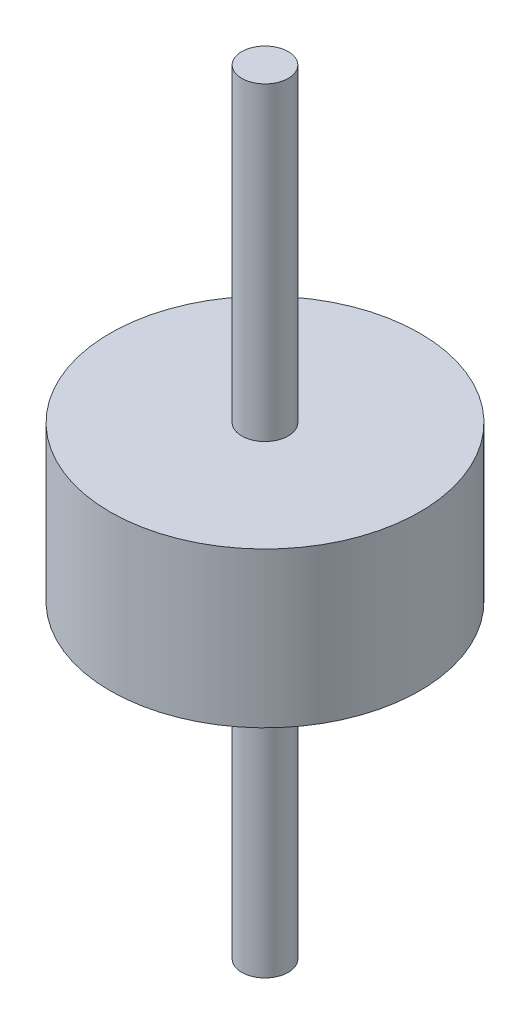
ISO-10303-21;
HEADER;
FILE_DESCRIPTION(('STEP AP214'),'2;1');
FILE_NAME('part.step','',(''),(''),'','','');
FILE_SCHEMA(('AUTOMOTIVE_DESIGN { 1 0 10303 214 1 1 1 1 }'));
ENDSEC;
DATA;
#1=APPLICATION_CONTEXT('core data for automotive mechanical design processes');
#2=APPLICATION_PROTOCOL_DEFINITION('international standard','automotive_design',2000,#1);
#3=PRODUCT_CONTEXT('',#1,'mechanical');
#4=PRODUCT('Part','Part','',(#3));
#5=PRODUCT_RELATED_PRODUCT_CATEGORY('part','',(#4));
#6=PRODUCT_DEFINITION_FORMATION('','',#4);
#7=PRODUCT_DEFINITION_CONTEXT('part definition',#1,'design');
#8=PRODUCT_DEFINITION('design','',#6,#7);
#9=PRODUCT_DEFINITION_SHAPE('','',#8);
#10=(LENGTH_UNIT() NAMED_UNIT(*) SI_UNIT(.MILLI.,.METRE.));
#11=(NAMED_UNIT(*) PLANE_ANGLE_UNIT() SI_UNIT($,.RADIAN.));
#12=(NAMED_UNIT(*) SI_UNIT($,.STERADIAN.) SOLID_ANGLE_UNIT());
#13=UNCERTAINTY_MEASURE_WITH_UNIT(LENGTH_MEASURE(1.E-05),#10,'distance_accuracy_value','');
#14=(GEOMETRIC_REPRESENTATION_CONTEXT(3) GLOBAL_UNCERTAINTY_ASSIGNED_CONTEXT((#13)) GLOBAL_UNIT_ASSIGNED_CONTEXT((#10,
#11,#12)) REPRESENTATION_CONTEXT('',''));
#15=CARTESIAN_POINT('',(0.,0.,0.));
#16=DIRECTION('',(0.,0.,1.));
#17=DIRECTION('',(1.,0.,0.));
#18=AXIS2_PLACEMENT_3D('',#15,#16,#17);
#19=CARTESIAN_POINT('',(-10.1198617892892,5.08,11.3020886338323));
#20=DIRECTION('',(0.,-1.,0.));
#21=DIRECTION('',(0.,0.,-1.));
#22=AXIS2_PLACEMENT_3D('',#19,#20,#21);
#23=CYLINDRICAL_SURFACE('',#22,5.08);
#24=CARTESIAN_POINT('',(-10.1198617892892,5.08,11.3020886338323));
#25=DIRECTION('',(0.,1.,0.));
#26=DIRECTION('',(0.,0.,1.));
#27=AXIS2_PLACEMENT_3D('',#24,#25,#26);
#28=CIRCLE('',#27,5.08);
#29=CARTESIAN_POINT('',(-10.1198617892892,5.08,16.3820886338323));
#30=VERTEX_POINT('',#29);
#31=EDGE_CURVE('E53',#30,#30,#28,.T.);
#32=ORIENTED_EDGE('',*,*,#31,.F.);
#33=EDGE_LOOP('',(#32));
#34=FACE_BOUND('',#33,.T.);
#35=CARTESIAN_POINT('',(-10.1198617892892,0.,11.3020886338323));
#36=DIRECTION('',(0.,1.,0.));
#37=DIRECTION('',(0.,0.,1.));
#38=AXIS2_PLACEMENT_3D('',#35,#36,#37);
#39=CIRCLE('',#38,5.08);
#40=CARTESIAN_POINT('',(-10.1198617892892,0.,16.3820886338323));
#41=VERTEX_POINT('',#40);
#42=EDGE_CURVE('E42',#41,#41,#39,.T.);
#43=ORIENTED_EDGE('',*,*,#42,.T.);
#44=EDGE_LOOP('',(#43));
#45=FACE_BOUND('',#44,.T.);
#46=ADVANCED_FACE('F39',(#34,#45),#23,.T.);
#47=CARTESIAN_POINT('',(-10.1198617892892,5.08,11.3020886338323));
#48=DIRECTION('',(0.,1.,0.));
#49=DIRECTION('',(0.,0.,1.));
#50=AXIS2_PLACEMENT_3D('',#47,#48,#49);
#51=PLANE('',#50);
#52=CARTESIAN_POINT('',(-10.1198617892892,5.08,11.3020886338323));
#53=DIRECTION('',(0.,1.,0.));
#54=DIRECTION('',(0.,0.,1.));
#55=AXIS2_PLACEMENT_3D('',#52,#53,#54);
#56=CIRCLE('',#55,0.762000000000001);
#57=CARTESIAN_POINT('',(-10.1198617892892,5.08,12.0640886338323));
#58=VERTEX_POINT('',#57);
#59=EDGE_CURVE('E47',#58,#58,#56,.T.);
#60=ORIENTED_EDGE('',*,*,#59,.F.);
#61=EDGE_LOOP('',(#60));
#62=FACE_BOUND('',#61,.T.);
#63=ORIENTED_EDGE('',*,*,#31,.T.);
#64=EDGE_LOOP('',(#63));
#65=FACE_BOUND('',#64,.T.);
#66=ADVANCED_FACE('F73',(#62,#65),#51,.T.);
#67=CARTESIAN_POINT('',(-10.1198617892892,0.,11.3020886338323));
#68=DIRECTION('',(0.,1.,0.));
#69=DIRECTION('',(0.,0.,1.));
#70=AXIS2_PLACEMENT_3D('',#67,#68,#69);
#71=PLANE('',#70);
#72=CARTESIAN_POINT('',(-10.1198617892892,0.,11.3020886338323));
#73=DIRECTION('',(0.,-1.,0.));
#74=DIRECTION('',(0.,0.,-1.));
#75=AXIS2_PLACEMENT_3D('',#72,#73,#74);
#76=CIRCLE('',#75,0.762000000000001);
#77=CARTESIAN_POINT('',(-10.1198617892892,0.,10.5400886338323));
#78=VERTEX_POINT('',#77);
#79=EDGE_CURVE('E10',#78,#78,#76,.T.);
#80=ORIENTED_EDGE('',*,*,#79,.F.);
#81=EDGE_LOOP('',(#80));
#82=FACE_BOUND('',#81,.T.);
#83=ORIENTED_EDGE('',*,*,#42,.F.);
#84=EDGE_LOOP('',(#83));
#85=FACE_BOUND('',#84,.T.);
#86=ADVANCED_FACE('F70',(#82,#85),#71,.F.);
#87=CARTESIAN_POINT('',(-10.1198617892892,15.24,11.3020886338323));
#88=DIRECTION('',(0.,-1.,0.));
#89=DIRECTION('',(0.,0.,-1.));
#90=AXIS2_PLACEMENT_3D('',#87,#88,#89);
#91=CYLINDRICAL_SURFACE('',#90,0.762000000000001);
#92=CARTESIAN_POINT('',(-10.1198617892892,15.24,11.3020886338323));
#93=DIRECTION('',(0.,1.,0.));
#94=DIRECTION('',(0.,0.,1.));
#95=AXIS2_PLACEMENT_3D('',#92,#93,#94);
#96=CIRCLE('',#95,0.762000000000001);
#97=CARTESIAN_POINT('',(-10.1198617892892,15.24,12.0640886338323));
#98=VERTEX_POINT('',#97);
#99=EDGE_CURVE('E58',#98,#98,#96,.T.);
#100=ORIENTED_EDGE('',*,*,#99,.F.);
#101=EDGE_LOOP('',(#100));
#102=FACE_BOUND('',#101,.T.);
#103=ORIENTED_EDGE('',*,*,#59,.T.);
#104=EDGE_LOOP('',(#103));
#105=FACE_BOUND('',#104,.T.);
#106=ADVANCED_FACE('F72',(#102,#105),#91,.T.);
#107=CARTESIAN_POINT('',(-10.1198617892892,15.24,11.3020886338323));
#108=DIRECTION('',(0.,1.,0.));
#109=DIRECTION('',(0.,0.,1.));
#110=AXIS2_PLACEMENT_3D('',#107,#108,#109);
#111=PLANE('',#110);
#112=ORIENTED_EDGE('',*,*,#99,.T.);
#113=EDGE_LOOP('',(#112));
#114=FACE_BOUND('',#113,.T.);
#115=ADVANCED_FACE('F79',(#114),#111,.T.);
#116=CARTESIAN_POINT('',(-10.1198617892892,-10.16,11.3020886338323));
#117=DIRECTION('',(0.,1.,0.));
#118=DIRECTION('',(0.,0.,1.));
#119=AXIS2_PLACEMENT_3D('',#116,#117,#118);
#120=CYLINDRICAL_SURFACE('',#119,0.762000000000001);
#121=CARTESIAN_POINT('',(-10.1198617892892,-10.16,11.3020886338323));
#122=DIRECTION('',(0.,-1.,0.));
#123=DIRECTION('',(0.,0.,-1.));
#124=AXIS2_PLACEMENT_3D('',#121,#122,#123);
#125=CIRCLE('',#124,0.762000000000001);
#126=CARTESIAN_POINT('',(-10.1198617892892,-10.16,10.5400886338323));
#127=VERTEX_POINT('',#126);
#128=EDGE_CURVE('E57',#127,#127,#125,.T.);
#129=ORIENTED_EDGE('',*,*,#128,.F.);
#130=EDGE_LOOP('',(#129));
#131=FACE_BOUND('',#130,.T.);
#132=ORIENTED_EDGE('',*,*,#79,.T.);
#133=EDGE_LOOP('',(#132));
#134=FACE_BOUND('',#133,.T.);
#135=ADVANCED_FACE('F107',(#131,#134),#120,.T.);
#136=CARTESIAN_POINT('',(-10.1198617892892,-10.16,11.3020886338323));
#137=DIRECTION('',(0.,-1.,0.));
#138=DIRECTION('',(0.,0.,-1.));
#139=AXIS2_PLACEMENT_3D('',#136,#137,#138);
#140=PLANE('',#139);
#141=ORIENTED_EDGE('',*,*,#128,.T.);
#142=EDGE_LOOP('',(#141));
#143=FACE_BOUND('',#142,.T.);
#144=ADVANCED_FACE('F121',(#143),#140,.T.);
#145=CLOSED_SHELL('',(#46,#66,#86,#106,#115,#135,#144));
#146=MANIFOLD_SOLID_BREP('B2',#145);
#147=ADVANCED_BREP_SHAPE_REPRESENTATION('',(#18,#146),#14);
#148=SHAPE_DEFINITION_REPRESENTATION(#9,#147);
ENDSEC;
END-ISO-10303-21;
